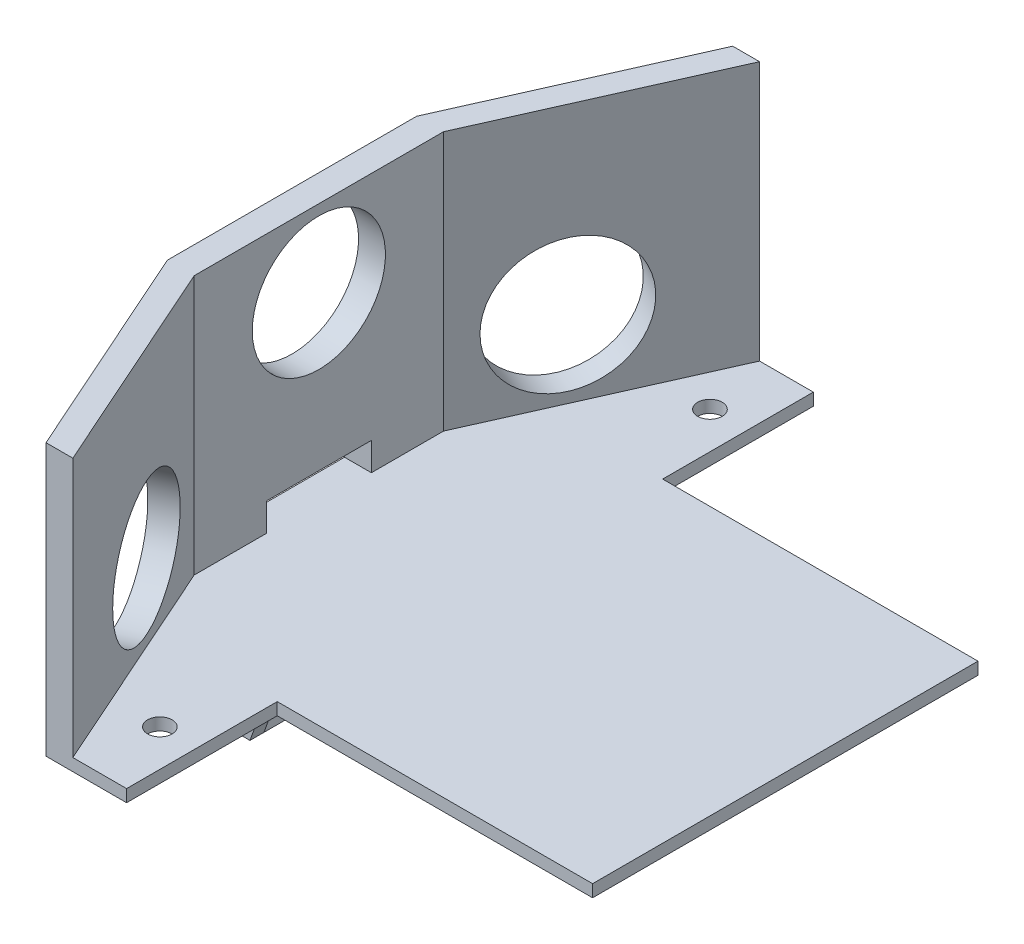
ISO-10303-21;
HEADER;
FILE_DESCRIPTION(('STEP AP214'),'2;1');
FILE_NAME('part.step','',(''),(''),'','','');
FILE_SCHEMA(('AUTOMOTIVE_DESIGN { 1 0 10303 214 1 1 1 1 }'));
ENDSEC;
DATA;
#1=APPLICATION_CONTEXT('core data for automotive mechanical design processes');
#2=APPLICATION_PROTOCOL_DEFINITION('international standard','automotive_design',2000,#1);
#3=PRODUCT_CONTEXT('',#1,'mechanical');
#4=PRODUCT('Part','Part','',(#3));
#5=PRODUCT_RELATED_PRODUCT_CATEGORY('part','',(#4));
#6=PRODUCT_DEFINITION_FORMATION('','',#4);
#7=PRODUCT_DEFINITION_CONTEXT('part definition',#1,'design');
#8=PRODUCT_DEFINITION('design','',#6,#7);
#9=PRODUCT_DEFINITION_SHAPE('','',#8);
#10=(LENGTH_UNIT() NAMED_UNIT(*) SI_UNIT(.MILLI.,.METRE.));
#11=(NAMED_UNIT(*) PLANE_ANGLE_UNIT() SI_UNIT($,.RADIAN.));
#12=(NAMED_UNIT(*) SI_UNIT($,.STERADIAN.) SOLID_ANGLE_UNIT());
#13=UNCERTAINTY_MEASURE_WITH_UNIT(LENGTH_MEASURE(1.E-05),#10,'distance_accuracy_value','');
#14=(GEOMETRIC_REPRESENTATION_CONTEXT(3) GLOBAL_UNCERTAINTY_ASSIGNED_CONTEXT((#13)) GLOBAL_UNIT_ASSIGNED_CONTEXT((#10,
#11,#12)) REPRESENTATION_CONTEXT('',''));
#15=CARTESIAN_POINT('',(0.,0.,0.));
#16=DIRECTION('',(0.,0.,1.));
#17=DIRECTION('',(1.,0.,0.));
#18=AXIS2_PLACEMENT_3D('',#15,#16,#17);
#19=CARTESIAN_POINT('',(0.,3.,0.));
#20=DIRECTION('',(0.,-1.,0.));
#21=DIRECTION('',(0.,0.,-1.));
#22=AXIS2_PLACEMENT_3D('',#19,#20,#21);
#23=PLANE('',#22);
#24=CARTESIAN_POINT('',(-142.75,3.,-39.5));
#25=DIRECTION('',(0.,1.,0.));
#26=DIRECTION('',(0.,0.,1.));
#27=AXIS2_PLACEMENT_3D('',#24,#25,#26);
#28=CIRCLE('',#27,1.75000000000001);
#29=CARTESIAN_POINT('',(-142.75,3.,-37.75));
#30=VERTEX_POINT('',#29);
#31=EDGE_CURVE('E414',#30,#30,#28,.T.);
#32=ORIENTED_EDGE('',*,*,#31,.T.);
#33=EDGE_LOOP('',(#32));
#34=FACE_BOUND('',#33,.T.);
#35=CARTESIAN_POINT('',(-142.75,3.,38.9999999999498));
#36=DIRECTION('',(0.,1.,0.));
#37=DIRECTION('',(0.,0.,1.));
#38=AXIS2_PLACEMENT_3D('',#35,#36,#37);
#39=CIRCLE('',#38,1.74999999998534);
#40=CARTESIAN_POINT('',(-142.75,3.,40.7499999999352));
#41=VERTEX_POINT('',#40);
#42=EDGE_CURVE('E409',#41,#41,#39,.T.);
#43=ORIENTED_EDGE('',*,*,#42,.T.);
#44=EDGE_LOOP('',(#43));
#45=FACE_BOUND('',#44,.T.);
#46=DIRECTION('',(0.,0.,1.));
#47=VECTOR('',#46,1.);
#48=CARTESIAN_POINT('',(-161.39501899441,3.,-7.5));
#49=LINE('',#48,#47);
#50=CARTESIAN_POINT('',(-161.39501899441,3.,-5.5));
#51=VERTEX_POINT('',#50);
#52=CARTESIAN_POINT('',(-161.39501899441,3.,5.5));
#53=VERTEX_POINT('',#52);
#54=EDGE_CURVE('E316',#51,#53,#49,.T.);
#55=ORIENTED_EDGE('',*,*,#54,.F.);
#56=DIRECTION('',(-1.,0.,0.));
#57=VECTOR('',#56,1.);
#58=CARTESIAN_POINT('',(-152.39501899441,3.,-5.5));
#59=LINE('',#58,#57);
#60=CARTESIAN_POINT('',(-152.39501899441,3.,-5.5));
#61=VERTEX_POINT('',#60);
#62=EDGE_CURVE('E254',#61,#51,#59,.T.);
#63=ORIENTED_EDGE('',*,*,#62,.F.);
#64=DIRECTION('',(0.,0.,-1.));
#65=VECTOR('',#64,1.);
#66=CARTESIAN_POINT('',(-152.39501899441,3.,-5.5));
#67=LINE('',#66,#65);
#68=CARTESIAN_POINT('',(-152.39501899441,3.,-7.5));
#69=VERTEX_POINT('',#68);
#70=EDGE_CURVE('E264',#61,#69,#67,.T.);
#71=ORIENTED_EDGE('',*,*,#70,.T.);
#72=DIRECTION('',(1.,0.,0.));
#73=VECTOR('',#72,1.);
#74=CARTESIAN_POINT('',(-162.89501899441,3.,-7.5));
#75=LINE('',#74,#73);
#76=CARTESIAN_POINT('',(-162.89501899441,3.,-7.5));
#77=VERTEX_POINT('',#76);
#78=EDGE_CURVE('E292',#77,#69,#75,.T.);
#79=ORIENTED_EDGE('',*,*,#78,.F.);
#80=DIRECTION('',(0.,0.,1.));
#81=VECTOR('',#80,1.);
#82=CARTESIAN_POINT('',(-162.89501899441,3.,17.791276364422));
#83=LINE('',#82,#81);
#84=CARTESIAN_POINT('',(-162.89501899441,3.,-17.791276364422));
#85=VERTEX_POINT('',#84);
#86=EDGE_CURVE('E463',#85,#77,#83,.T.);
#87=ORIENTED_EDGE('',*,*,#86,.F.);
#88=DIRECTION('',(-0.406736643075407,0.,0.913545457642776));
#89=VECTOR('',#88,1.);
#90=CARTESIAN_POINT('',(-162.89501899441,3.,-17.791276364422));
#91=LINE('',#90,#89);
#92=CARTESIAN_POINT('',(-149.,3.,-49.));
#93=VERTEX_POINT('',#92);
#94=EDGE_CURVE('E459',#93,#85,#91,.T.);
#95=ORIENTED_EDGE('',*,*,#94,.F.);
#96=DIRECTION('',(-1.,0.,0.));
#97=VECTOR('',#96,1.);
#98=CARTESIAN_POINT('',(-149.,3.,-49.));
#99=LINE('',#98,#97);
#100=CARTESIAN_POINT('',(-137.5,3.,-49.));
#101=VERTEX_POINT('',#100);
#102=EDGE_CURVE('E456',#101,#93,#99,.T.);
#103=ORIENTED_EDGE('',*,*,#102,.F.);
#104=DIRECTION('',(0.,0.,-1.));
#105=VECTOR('',#104,1.);
#106=CARTESIAN_POINT('',(-137.5,3.,-49.));
#107=LINE('',#106,#105);
#108=CARTESIAN_POINT('',(-137.5,3.,-27.5));
#109=VERTEX_POINT('',#108);
#110=EDGE_CURVE('E453',#109,#101,#107,.T.);
#111=ORIENTED_EDGE('',*,*,#110,.F.);
#112=DIRECTION('',(-1.,0.,0.));
#113=VECTOR('',#112,1.);
#114=CARTESIAN_POINT('',(-137.5,3.,-27.5));
#115=LINE('',#114,#113);
#116=CARTESIAN_POINT('',(-92.4999999999998,3.,-27.5));
#117=VERTEX_POINT('',#116);
#118=EDGE_CURVE('E422',#117,#109,#115,.T.);
#119=ORIENTED_EDGE('',*,*,#118,.F.);
#120=DIRECTION('',(0.,0.,-1.));
#121=VECTOR('',#120,1.);
#122=CARTESIAN_POINT('',(-92.4999999999998,3.,-27.5));
#123=LINE('',#122,#121);
#124=CARTESIAN_POINT('',(-92.4999999999998,3.,27.5));
#125=VERTEX_POINT('',#124);
#126=EDGE_CURVE('E431',#125,#117,#123,.T.);
#127=ORIENTED_EDGE('',*,*,#126,.F.);
#128=DIRECTION('',(1.,0.,0.));
#129=VECTOR('',#128,1.);
#130=CARTESIAN_POINT('',(-92.4999999999998,3.,27.5));
#131=LINE('',#130,#129);
#132=CARTESIAN_POINT('',(-137.499999999887,3.,27.5));
#133=VERTEX_POINT('',#132);
#134=EDGE_CURVE('E476',#133,#125,#131,.T.);
#135=ORIENTED_EDGE('',*,*,#134,.F.);
#136=DIRECTION('',(0.,0.,-1.));
#137=VECTOR('',#136,1.);
#138=CARTESIAN_POINT('',(-137.499999999887,3.,27.5));
#139=LINE('',#138,#137);
#140=CARTESIAN_POINT('',(-137.499999999887,3.,48.9999999999498));
#141=VERTEX_POINT('',#140);
#142=EDGE_CURVE('E473',#141,#133,#139,.T.);
#143=ORIENTED_EDGE('',*,*,#142,.F.);
#144=DIRECTION('',(1.,0.,0.));
#145=VECTOR('',#144,1.);
#146=CARTESIAN_POINT('',(-137.499999999887,3.,48.9999999999498));
#147=LINE('',#146,#145);
#148=CARTESIAN_POINT('',(-148.999999999887,3.,48.9999999999498));
#149=VERTEX_POINT('',#148);
#150=EDGE_CURVE('E470',#149,#141,#147,.T.);
#151=ORIENTED_EDGE('',*,*,#150,.F.);
#152=DIRECTION('',(0.406736643078705,0.,0.913545457641307));
#153=VECTOR('',#152,1.);
#154=CARTESIAN_POINT('',(-148.999999999887,3.,48.9999999999498));
#155=LINE('',#154,#153);
#156=CARTESIAN_POINT('',(-162.89501899441,3.,17.791276364422));
#157=VERTEX_POINT('',#156);
#158=EDGE_CURVE('E467',#157,#149,#155,.T.);
#159=ORIENTED_EDGE('',*,*,#158,.F.);
#160=CARTESIAN_POINT('',(-162.89501899441,3.,7.5));
#161=VERTEX_POINT('',#160);
#162=EDGE_CURVE('E462',#161,#157,#83,.T.);
#163=ORIENTED_EDGE('',*,*,#162,.F.);
#164=DIRECTION('',(-1.,0.,0.));
#165=VECTOR('',#164,1.);
#166=CARTESIAN_POINT('',(-162.89501899441,3.,7.5));
#167=LINE('',#166,#165);
#168=CARTESIAN_POINT('',(-152.39501899441,3.,7.5));
#169=VERTEX_POINT('',#168);
#170=EDGE_CURVE('E301',#169,#161,#167,.T.);
#171=ORIENTED_EDGE('',*,*,#170,.F.);
#172=DIRECTION('',(0.,0.,1.));
#173=VECTOR('',#172,1.);
#174=CARTESIAN_POINT('',(-152.39501899441,3.,5.5));
#175=LINE('',#174,#173);
#176=CARTESIAN_POINT('',(-152.39501899441,3.,5.5));
#177=VERTEX_POINT('',#176);
#178=EDGE_CURVE('E288',#177,#169,#175,.T.);
#179=ORIENTED_EDGE('',*,*,#178,.F.);
#180=DIRECTION('',(-1.,0.,0.));
#181=VECTOR('',#180,1.);
#182=CARTESIAN_POINT('',(-152.39501899441,3.,5.5));
#183=LINE('',#182,#181);
#184=EDGE_CURVE('E272',#177,#53,#183,.T.);
#185=ORIENTED_EDGE('',*,*,#184,.T.);
#186=EDGE_LOOP('',(#55,#63,#71,#79,#87,#95,#103,#111,#119,#127,#135,#143,#151,#159,#163,#171,
#179,#185));
#187=FACE_BOUND('',#186,.T.);
#188=ADVANCED_FACE('F40',(#34,#45,#187),#23,.T.);
#189=CARTESIAN_POINT('',(-161.39501899441,-22.,-7.5));
#190=DIRECTION('',(-1.,0.,0.));
#191=DIRECTION('',(0.,0.,1.));
#192=AXIS2_PLACEMENT_3D('',#189,#190,#191);
#193=PLANE('',#192);
#194=DIRECTION('',(0.,-1.,0.));
#195=VECTOR('',#194,1.);
#196=CARTESIAN_POINT('',(-161.39501899441,3.,-5.5));
#197=LINE('',#196,#195);
#198=CARTESIAN_POINT('',(-161.39501899441,-22.,-5.5));
#199=VERTEX_POINT('',#198);
#200=EDGE_CURVE('E260',#51,#199,#197,.T.);
#201=ORIENTED_EDGE('',*,*,#200,.F.);
#202=ORIENTED_EDGE('',*,*,#54,.T.);
#203=DIRECTION('',(0.,-1.,0.));
#204=VECTOR('',#203,1.);
#205=CARTESIAN_POINT('',(-161.39501899441,3.,5.5));
#206=LINE('',#205,#204);
#207=CARTESIAN_POINT('',(-161.39501899441,-22.,5.5));
#208=VERTEX_POINT('',#207);
#209=EDGE_CURVE('E276',#53,#208,#206,.T.);
#210=ORIENTED_EDGE('',*,*,#209,.T.);
#211=DIRECTION('',(0.,0.,1.));
#212=VECTOR('',#211,1.);
#213=CARTESIAN_POINT('',(-161.39501899441,-22.,-7.5));
#214=LINE('',#213,#212);
#215=EDGE_CURVE('E305',#199,#208,#214,.T.);
#216=ORIENTED_EDGE('',*,*,#215,.F.);
#217=EDGE_LOOP('',(#201,#202,#210,#216));
#218=FACE_BOUND('',#217,.T.);
#219=ADVANCED_FACE('F593',(#218),#193,.F.);
#220=CARTESIAN_POINT('',(0.,4.75,0.));
#221=DIRECTION('',(0.,-1.,0.));
#222=DIRECTION('',(0.,0.,-1.));
#223=AXIS2_PLACEMENT_3D('',#220,#221,#222);
#224=PLANE('',#223);
#225=CARTESIAN_POINT('',(-142.75,4.75,38.9999999999498));
#226=DIRECTION('',(0.,1.,0.));
#227=DIRECTION('',(0.,0.,1.));
#228=AXIS2_PLACEMENT_3D('',#225,#226,#227);
#229=CIRCLE('',#228,1.74999999998534);
#230=CARTESIAN_POINT('',(-142.75,4.75,40.7499999999352));
#231=VERTEX_POINT('',#230);
#232=EDGE_CURVE('E410',#231,#231,#229,.T.);
#233=ORIENTED_EDGE('',*,*,#232,.F.);
#234=EDGE_LOOP('',(#233));
#235=FACE_BOUND('',#234,.T.);
#236=CARTESIAN_POINT('',(-142.75,4.75,-39.5));
#237=DIRECTION('',(0.,1.,0.));
#238=DIRECTION('',(0.,0.,1.));
#239=AXIS2_PLACEMENT_3D('',#236,#237,#238);
#240=CIRCLE('',#239,1.75000000000001);
#241=CARTESIAN_POINT('',(-142.75,4.75,-37.75));
#242=VERTEX_POINT('',#241);
#243=EDGE_CURVE('E418',#242,#242,#240,.T.);
#244=ORIENTED_EDGE('',*,*,#243,.F.);
#245=EDGE_LOOP('',(#244));
#246=FACE_BOUND('',#245,.T.);
#247=DIRECTION('',(0.406736643075407,0.,-0.913545457642776));
#248=VECTOR('',#247,1.);
#249=CARTESIAN_POINT('',(-145.16877302523,4.75,-49.));
#250=LINE('',#249,#248);
#251=CARTESIAN_POINT('',(-159.063792019639,4.75,-17.791276364422));
#252=VERTEX_POINT('',#251);
#253=CARTESIAN_POINT('',(-145.16877302523,4.75,-49.));
#254=VERTEX_POINT('',#253);
#255=EDGE_CURVE('E359',#252,#254,#250,.T.);
#256=ORIENTED_EDGE('',*,*,#255,.F.);
#257=DIRECTION('',(0.,0.,-1.));
#258=VECTOR('',#257,1.);
#259=CARTESIAN_POINT('',(-159.063792019639,4.75,-17.791276364422));
#260=LINE('',#259,#258);
#261=CARTESIAN_POINT('',(-159.063792019639,4.75,-7.5));
#262=VERTEX_POINT('',#261);
#263=EDGE_CURVE('E387',#262,#252,#260,.T.);
#264=ORIENTED_EDGE('',*,*,#263,.F.);
#265=DIRECTION('',(1.,0.,0.));
#266=VECTOR('',#265,1.);
#267=CARTESIAN_POINT('',(-162.89601899441,4.75,-7.5));
#268=LINE('',#267,#266);
#269=CARTESIAN_POINT('',(-162.89501899441,4.75,-7.5));
#270=VERTEX_POINT('',#269);
#271=EDGE_CURVE('E215',#270,#262,#268,.T.);
#272=ORIENTED_EDGE('',*,*,#271,.F.);
#273=DIRECTION('',(0.,0.,1.));
#274=VECTOR('',#273,1.);
#275=CARTESIAN_POINT('',(-162.89501899441,4.75,7.5));
#276=LINE('',#275,#274);
#277=CARTESIAN_POINT('',(-162.89501899441,4.75,7.5));
#278=VERTEX_POINT('',#277);
#279=EDGE_CURVE('E219',#270,#278,#276,.T.);
#280=ORIENTED_EDGE('',*,*,#279,.T.);
#281=DIRECTION('',(1.,0.,0.));
#282=VECTOR('',#281,1.);
#283=CARTESIAN_POINT('',(-162.89601899441,4.75,7.5));
#284=LINE('',#283,#282);
#285=CARTESIAN_POINT('',(-159.063792019639,4.75,7.5));
#286=VERTEX_POINT('',#285);
#287=EDGE_CURVE('E206',#278,#286,#284,.T.);
#288=ORIENTED_EDGE('',*,*,#287,.T.);
#289=CARTESIAN_POINT('',(-159.063792019639,4.75,17.791276364422));
#290=VERTEX_POINT('',#289);
#291=EDGE_CURVE('E388',#290,#286,#260,.T.);
#292=ORIENTED_EDGE('',*,*,#291,.F.);
#293=DIRECTION('',(-0.406736643078705,0.,-0.913545457641307));
#294=VECTOR('',#293,1.);
#295=CARTESIAN_POINT('',(-159.063792019639,4.75,17.791276364422));
#296=LINE('',#295,#294);
#297=CARTESIAN_POINT('',(-145.168773025117,4.75,48.9999999999498));
#298=VERTEX_POINT('',#297);
#299=EDGE_CURVE('E353',#298,#290,#296,.T.);
#300=ORIENTED_EDGE('',*,*,#299,.F.);
#301=DIRECTION('',(1.,0.,0.));
#302=VECTOR('',#301,1.);
#303=CARTESIAN_POINT('',(-137.499999999887,4.75,48.9999999999498));
#304=LINE('',#303,#302);
#305=CARTESIAN_POINT('',(-137.499999999887,4.75,48.9999999999498));
#306=VERTEX_POINT('',#305);
#307=EDGE_CURVE('E437',#298,#306,#304,.T.);
#308=ORIENTED_EDGE('',*,*,#307,.T.);
#309=DIRECTION('',(0.,0.,-1.));
#310=VECTOR('',#309,1.);
#311=CARTESIAN_POINT('',(-137.499999999887,4.75,27.5));
#312=LINE('',#311,#310);
#313=CARTESIAN_POINT('',(-137.499999999887,4.75,27.5));
#314=VERTEX_POINT('',#313);
#315=EDGE_CURVE('E440',#306,#314,#312,.T.);
#316=ORIENTED_EDGE('',*,*,#315,.T.);
#317=DIRECTION('',(1.,0.,0.));
#318=VECTOR('',#317,1.);
#319=CARTESIAN_POINT('',(-92.4999999999998,4.75,27.5));
#320=LINE('',#319,#318);
#321=CARTESIAN_POINT('',(-92.4999999999998,4.75,27.5));
#322=VERTEX_POINT('',#321);
#323=EDGE_CURVE('E443',#314,#322,#320,.T.);
#324=ORIENTED_EDGE('',*,*,#323,.T.);
#325=DIRECTION('',(0.,0.,-1.));
#326=VECTOR('',#325,1.);
#327=CARTESIAN_POINT('',(-92.4999999999998,4.75,-27.5));
#328=LINE('',#327,#326);
#329=CARTESIAN_POINT('',(-92.4999999999998,4.75,-27.5));
#330=VERTEX_POINT('',#329);
#331=EDGE_CURVE('E446',#322,#330,#328,.T.);
#332=ORIENTED_EDGE('',*,*,#331,.T.);
#333=DIRECTION('',(-1.,0.,0.));
#334=VECTOR('',#333,1.);
#335=CARTESIAN_POINT('',(-137.5,4.75,-27.5));
#336=LINE('',#335,#334);
#337=CARTESIAN_POINT('',(-137.5,4.75,-27.5));
#338=VERTEX_POINT('',#337);
#339=EDGE_CURVE('E426',#330,#338,#336,.T.);
#340=ORIENTED_EDGE('',*,*,#339,.T.);
#341=DIRECTION('',(0.,0.,-1.));
#342=VECTOR('',#341,1.);
#343=CARTESIAN_POINT('',(-137.5,4.75,-49.));
#344=LINE('',#343,#342);
#345=CARTESIAN_POINT('',(-137.5,4.75,-49.));
#346=VERTEX_POINT('',#345);
#347=EDGE_CURVE('E430',#338,#346,#344,.T.);
#348=ORIENTED_EDGE('',*,*,#347,.T.);
#349=DIRECTION('',(-1.,0.,0.));
#350=VECTOR('',#349,1.);
#351=CARTESIAN_POINT('',(-149.,4.75,-49.));
#352=LINE('',#351,#350);
#353=EDGE_CURVE('E434',#346,#254,#352,.T.);
#354=ORIENTED_EDGE('',*,*,#353,.T.);
#355=EDGE_LOOP('',(#256,#264,#272,#280,#288,#292,#300,#308,#316,#324,#332,#340,#348,#354));
#356=FACE_BOUND('',#355,.T.);
#357=ADVANCED_FACE('F221',(#235,#246,#356),#224,.F.);
#358=CARTESIAN_POINT('',(-137.5,4.75,-27.5));
#359=DIRECTION('',(0.,0.,1.));
#360=DIRECTION('',(1.,0.,0.));
#361=AXIS2_PLACEMENT_3D('',#358,#359,#360);
#362=PLANE('',#361);
#363=ORIENTED_EDGE('',*,*,#118,.T.);
#364=DIRECTION('',(0.,-1.,0.));
#365=VECTOR('',#364,1.);
#366=CARTESIAN_POINT('',(-137.5,4.75,-27.5));
#367=LINE('',#366,#365);
#368=EDGE_CURVE('E11',#338,#109,#367,.T.);
#369=ORIENTED_EDGE('',*,*,#368,.F.);
#370=ORIENTED_EDGE('',*,*,#339,.F.);
#371=DIRECTION('',(0.,-1.,0.));
#372=VECTOR('',#371,1.);
#373=CARTESIAN_POINT('',(-92.4999999999998,4.75,-27.5));
#374=LINE('',#373,#372);
#375=EDGE_CURVE('E449',#330,#117,#374,.T.);
#376=ORIENTED_EDGE('',*,*,#375,.T.);
#377=EDGE_LOOP('',(#363,#369,#370,#376));
#378=FACE_BOUND('',#377,.T.);
#379=ADVANCED_FACE('F42',(#378),#362,.F.);
#380=CARTESIAN_POINT('',(-137.5,4.75,-49.));
#381=DIRECTION('',(-1.,0.,0.));
#382=DIRECTION('',(0.,0.,1.));
#383=AXIS2_PLACEMENT_3D('',#380,#381,#382);
#384=PLANE('',#383);
#385=ORIENTED_EDGE('',*,*,#110,.T.);
#386=DIRECTION('',(0.,-1.,0.));
#387=VECTOR('',#386,1.);
#388=CARTESIAN_POINT('',(-137.5,4.75,-49.));
#389=LINE('',#388,#387);
#390=EDGE_CURVE('E49',#346,#101,#389,.T.);
#391=ORIENTED_EDGE('',*,*,#390,.F.);
#392=ORIENTED_EDGE('',*,*,#347,.F.);
#393=ORIENTED_EDGE('',*,*,#368,.T.);
#394=EDGE_LOOP('',(#385,#391,#392,#393));
#395=FACE_BOUND('',#394,.T.);
#396=ADVANCED_FACE('F541',(#395),#384,.F.);
#397=CARTESIAN_POINT('',(-149.,4.75,-49.));
#398=DIRECTION('',(0.,0.,1.));
#399=DIRECTION('',(1.,0.,0.));
#400=AXIS2_PLACEMENT_3D('',#397,#398,#399);
#401=PLANE('',#400);
#402=ORIENTED_EDGE('',*,*,#102,.T.);
#403=DIRECTION('',(0.,-1.,0.));
#404=VECTOR('',#403,1.);
#405=CARTESIAN_POINT('',(-149.,4.75,-49.));
#406=LINE('',#405,#404);
#407=CARTESIAN_POINT('',(-149.,41.75,-49.));
#408=VERTEX_POINT('',#407);
#409=EDGE_CURVE('E508',#408,#93,#406,.T.);
#410=ORIENTED_EDGE('',*,*,#409,.F.);
#411=DIRECTION('',(-1.,0.,0.));
#412=VECTOR('',#411,1.);
#413=CARTESIAN_POINT('',(-149.,41.75,-49.));
#414=LINE('',#413,#412);
#415=CARTESIAN_POINT('',(-145.16877302523,41.75,-49.));
#416=VERTEX_POINT('',#415);
#417=EDGE_CURVE('E379',#416,#408,#414,.T.);
#418=ORIENTED_EDGE('',*,*,#417,.F.);
#419=DIRECTION('',(0.,-1.,0.));
#420=VECTOR('',#419,1.);
#421=CARTESIAN_POINT('',(-145.16877302523,41.75,-49.));
#422=LINE('',#421,#420);
#423=EDGE_CURVE('E383',#416,#254,#422,.T.);
#424=ORIENTED_EDGE('',*,*,#423,.T.);
#425=ORIENTED_EDGE('',*,*,#353,.F.);
#426=ORIENTED_EDGE('',*,*,#390,.T.);
#427=EDGE_LOOP('',(#402,#410,#418,#424,#425,#426));
#428=FACE_BOUND('',#427,.T.);
#429=ADVANCED_FACE('F517',(#428),#401,.F.);
#430=CARTESIAN_POINT('',(-162.89501899441,4.75,-17.791276364422));
#431=DIRECTION('',(0.913545457642776,0.,0.406736643075407));
#432=DIRECTION('',(0.406736643075407,0.,-0.913545457642776));
#433=AXIS2_PLACEMENT_3D('',#430,#431,#432);
#434=PLANE('',#433);
#435=CARTESIAN_POINT('',(-156.793969348261,15.75,-31.4944582291032));
#436=DIRECTION('',(-0.913545457642776,0.,-0.406736643075407));
#437=DIRECTION('',(-0.406736643075407,0.,0.913545457642776));
#438=AXIS2_PLACEMENT_3D('',#435,#436,#437);
#439=CIRCLE('',#438,9.50000000000001);
#440=CARTESIAN_POINT('',(-160.657967457477,15.75,-22.8157763814968));
#441=VERTEX_POINT('',#440);
#442=EDGE_CURVE('E345',#441,#441,#439,.T.);
#443=ORIENTED_EDGE('',*,*,#442,.F.);
#444=EDGE_LOOP('',(#443));
#445=FACE_BOUND('',#444,.T.);
#446=ORIENTED_EDGE('',*,*,#94,.T.);
#447=DIRECTION('',(0.,-1.,0.));
#448=VECTOR('',#447,1.);
#449=CARTESIAN_POINT('',(-162.89501899441,4.75,-17.791276364422));
#450=LINE('',#449,#448);
#451=CARTESIAN_POINT('',(-162.89501899441,41.75,-17.791276364422));
#452=VERTEX_POINT('',#451);
#453=EDGE_CURVE('E504',#452,#85,#450,.T.);
#454=ORIENTED_EDGE('',*,*,#453,.F.);
#455=DIRECTION('',(-0.406736643075407,0.,0.913545457642776));
#456=VECTOR('',#455,1.);
#457=CARTESIAN_POINT('',(-162.89501899441,41.75,-17.791276364422));
#458=LINE('',#457,#456);
#459=EDGE_CURVE('E354',#408,#452,#458,.T.);
#460=ORIENTED_EDGE('',*,*,#459,.F.);
#461=ORIENTED_EDGE('',*,*,#409,.T.);
#462=EDGE_LOOP('',(#446,#454,#460,#461));
#463=FACE_BOUND('',#462,.T.);
#464=ADVANCED_FACE('F525',(#445,#463),#434,.F.);
#465=CARTESIAN_POINT('',(-162.89501899441,4.75,17.791276364422));
#466=DIRECTION('',(1.,0.,0.));
#467=DIRECTION('',(0.,0.,-1.));
#468=AXIS2_PLACEMENT_3D('',#465,#466,#467);
#469=PLANE('',#468);
#470=DIRECTION('',(0.,0.,-1.));
#471=VECTOR('',#470,1.);
#472=CARTESIAN_POINT('',(-162.89501899441,8.75,7.5));
#473=LINE('',#472,#471);
#474=CARTESIAN_POINT('',(-162.89501899441,8.75,7.5));
#475=VERTEX_POINT('',#474);
#476=CARTESIAN_POINT('',(-162.89501899441,8.75,-7.5));
#477=VERTEX_POINT('',#476);
#478=EDGE_CURVE('E231',#475,#477,#473,.T.);
#479=ORIENTED_EDGE('',*,*,#478,.F.);
#480=DIRECTION('',(0.,1.,0.));
#481=VECTOR('',#480,1.);
#482=CARTESIAN_POINT('',(-162.89501899441,4.75,7.5));
#483=LINE('',#482,#481);
#484=EDGE_CURVE('E210',#278,#475,#483,.T.);
#485=ORIENTED_EDGE('',*,*,#484,.F.);
#486=ORIENTED_EDGE('',*,*,#279,.F.);
#487=DIRECTION('',(0.,-1.,0.));
#488=VECTOR('',#487,1.);
#489=CARTESIAN_POINT('',(-162.89501899441,4.75,-7.5));
#490=LINE('',#489,#488);
#491=EDGE_CURVE('E56',#477,#270,#490,.T.);
#492=ORIENTED_EDGE('',*,*,#491,.F.);
#493=EDGE_LOOP('',(#479,#485,#486,#492));
#494=FACE_BOUND('',#493,.T.);
#495=CARTESIAN_POINT('',(-162.89501899441,30.75,0.));
#496=DIRECTION('',(-1.,0.,0.));
#497=DIRECTION('',(0.,0.,1.));
#498=AXIS2_PLACEMENT_3D('',#495,#496,#497);
#499=CIRCLE('',#498,9.5);
#500=CARTESIAN_POINT('',(-162.89501899441,30.75,9.5));
#501=VERTEX_POINT('',#500);
#502=EDGE_CURVE('E329',#501,#501,#499,.T.);
#503=ORIENTED_EDGE('',*,*,#502,.F.);
#504=EDGE_LOOP('',(#503));
#505=FACE_BOUND('',#504,.T.);
#506=ORIENTED_EDGE('',*,*,#86,.T.);
#507=DIRECTION('',(0.,1.,0.));
#508=VECTOR('',#507,1.);
#509=CARTESIAN_POINT('',(-162.89501899441,-22.,-7.5));
#510=LINE('',#509,#508);
#511=CARTESIAN_POINT('',(-162.89501899441,-22.,-7.5));
#512=VERTEX_POINT('',#511);
#513=EDGE_CURVE('E325',#512,#77,#510,.T.);
#514=ORIENTED_EDGE('',*,*,#513,.F.);
#515=DIRECTION('',(0.,0.,-1.));
#516=VECTOR('',#515,1.);
#517=CARTESIAN_POINT('',(-162.89501899441,-22.,-7.5));
#518=LINE('',#517,#516);
#519=CARTESIAN_POINT('',(-162.89501899441,-22.,7.5));
#520=VERTEX_POINT('',#519);
#521=EDGE_CURVE('E296',#520,#512,#518,.T.);
#522=ORIENTED_EDGE('',*,*,#521,.F.);
#523=DIRECTION('',(0.,1.,0.));
#524=VECTOR('',#523,1.);
#525=CARTESIAN_POINT('',(-162.89501899441,-22.,7.5));
#526=LINE('',#525,#524);
#527=EDGE_CURVE('E313',#520,#161,#526,.T.);
#528=ORIENTED_EDGE('',*,*,#527,.T.);
#529=ORIENTED_EDGE('',*,*,#162,.T.);
#530=DIRECTION('',(0.,-1.,0.));
#531=VECTOR('',#530,1.);
#532=CARTESIAN_POINT('',(-162.89501899441,4.75,17.791276364422));
#533=LINE('',#532,#531);
#534=CARTESIAN_POINT('',(-162.89501899441,41.75,17.791276364422));
#535=VERTEX_POINT('',#534);
#536=EDGE_CURVE('E500',#535,#157,#533,.T.);
#537=ORIENTED_EDGE('',*,*,#536,.F.);
#538=DIRECTION('',(0.,0.,1.));
#539=VECTOR('',#538,1.);
#540=CARTESIAN_POINT('',(-162.89501899441,41.75,17.791276364422));
#541=LINE('',#540,#539);
#542=EDGE_CURVE('E358',#452,#535,#541,.T.);
#543=ORIENTED_EDGE('',*,*,#542,.F.);
#544=ORIENTED_EDGE('',*,*,#453,.T.);
#545=EDGE_LOOP('',(#506,#514,#522,#528,#529,#537,#543,#544));
#546=FACE_BOUND('',#545,.T.);
#547=ADVANCED_FACE('F228',(#494,#505,#546),#469,.F.);
#548=CARTESIAN_POINT('',(-148.999999999887,4.75,48.9999999999498));
#549=DIRECTION('',(0.913545457641308,0.,-0.406736643078705));
#550=DIRECTION('',(-0.406736643078705,0.,-0.913545457641308));
#551=AXIS2_PLACEMENT_3D('',#548,#549,#550);
#552=PLANE('',#551);
#553=CARTESIAN_POINT('',(-156.793969348228,15.75,31.4944582290454));
#554=DIRECTION('',(-0.913545457641307,0.,0.406736643078705));
#555=DIRECTION('',(0.406736643078705,0.,0.913545457641307));
#556=AXIS2_PLACEMENT_3D('',#553,#554,#555);
#557=CIRCLE('',#556,9.50000000000001);
#558=CARTESIAN_POINT('',(-152.92997123898,15.75,40.1731400766378));
#559=VERTEX_POINT('',#558);
#560=EDGE_CURVE('E337',#559,#559,#557,.T.);
#561=ORIENTED_EDGE('',*,*,#560,.F.);
#562=EDGE_LOOP('',(#561));
#563=FACE_BOUND('',#562,.T.);
#564=ORIENTED_EDGE('',*,*,#158,.T.);
#565=DIRECTION('',(0.,-1.,0.));
#566=VECTOR('',#565,1.);
#567=CARTESIAN_POINT('',(-148.999999999887,4.75,48.9999999999498));
#568=LINE('',#567,#566);
#569=CARTESIAN_POINT('',(-148.999999999887,41.75,48.9999999999498));
#570=VERTEX_POINT('',#569);
#571=EDGE_CURVE('E496',#570,#149,#568,.T.);
#572=ORIENTED_EDGE('',*,*,#571,.F.);
#573=DIRECTION('',(0.406736643078705,0.,0.913545457641307));
#574=VECTOR('',#573,1.);
#575=CARTESIAN_POINT('',(-148.999999999887,41.75,48.9999999999498));
#576=LINE('',#575,#574);
#577=EDGE_CURVE('E363',#535,#570,#576,.T.);
#578=ORIENTED_EDGE('',*,*,#577,.F.);
#579=ORIENTED_EDGE('',*,*,#536,.T.);
#580=EDGE_LOOP('',(#564,#572,#578,#579));
#581=FACE_BOUND('',#580,.T.);
#582=ADVANCED_FACE('F567',(#563,#581),#552,.F.);
#583=CARTESIAN_POINT('',(-137.499999999887,4.75,48.9999999999498));
#584=DIRECTION('',(0.,0.,-1.));
#585=DIRECTION('',(-1.,0.,0.));
#586=AXIS2_PLACEMENT_3D('',#583,#584,#585);
#587=PLANE('',#586);
#588=ORIENTED_EDGE('',*,*,#150,.T.);
#589=DIRECTION('',(0.,-1.,0.));
#590=VECTOR('',#589,1.);
#591=CARTESIAN_POINT('',(-137.499999999887,4.75,48.9999999999498));
#592=LINE('',#591,#590);
#593=EDGE_CURVE('E492',#306,#141,#592,.T.);
#594=ORIENTED_EDGE('',*,*,#593,.F.);
#595=ORIENTED_EDGE('',*,*,#307,.F.);
#596=DIRECTION('',(0.,-1.,0.));
#597=VECTOR('',#596,1.);
#598=CARTESIAN_POINT('',(-145.168773025117,41.75,48.9999999999498));
#599=LINE('',#598,#597);
#600=CARTESIAN_POINT('',(-145.168773025117,41.75,48.9999999999498));
#601=VERTEX_POINT('',#600);
#602=EDGE_CURVE('E405',#601,#298,#599,.T.);
#603=ORIENTED_EDGE('',*,*,#602,.F.);
#604=DIRECTION('',(1.,0.,0.));
#605=VECTOR('',#604,1.);
#606=CARTESIAN_POINT('',(-145.168773025117,41.75,48.9999999999498));
#607=LINE('',#606,#605);
#608=EDGE_CURVE('E367',#570,#601,#607,.T.);
#609=ORIENTED_EDGE('',*,*,#608,.F.);
#610=ORIENTED_EDGE('',*,*,#571,.T.);
#611=EDGE_LOOP('',(#588,#594,#595,#603,#609,#610));
#612=FACE_BOUND('',#611,.T.);
#613=ADVANCED_FACE('F562',(#612),#587,.F.);
#614=CARTESIAN_POINT('',(-137.499999999887,4.75,27.5));
#615=DIRECTION('',(-1.,0.,0.));
#616=DIRECTION('',(0.,0.,1.));
#617=AXIS2_PLACEMENT_3D('',#614,#615,#616);
#618=PLANE('',#617);
#619=ORIENTED_EDGE('',*,*,#142,.T.);
#620=DIRECTION('',(0.,-1.,0.));
#621=VECTOR('',#620,1.);
#622=CARTESIAN_POINT('',(-137.499999999887,4.75,27.5));
#623=LINE('',#622,#621);
#624=EDGE_CURVE('E488',#314,#133,#623,.T.);
#625=ORIENTED_EDGE('',*,*,#624,.F.);
#626=ORIENTED_EDGE('',*,*,#315,.F.);
#627=ORIENTED_EDGE('',*,*,#593,.T.);
#628=EDGE_LOOP('',(#619,#625,#626,#627));
#629=FACE_BOUND('',#628,.T.);
#630=ADVANCED_FACE('F557',(#629),#618,.F.);
#631=CARTESIAN_POINT('',(-92.4999999999998,4.75,27.5));
#632=DIRECTION('',(0.,0.,-1.));
#633=DIRECTION('',(-1.,0.,0.));
#634=AXIS2_PLACEMENT_3D('',#631,#632,#633);
#635=PLANE('',#634);
#636=ORIENTED_EDGE('',*,*,#134,.T.);
#637=DIRECTION('',(0.,-1.,0.));
#638=VECTOR('',#637,1.);
#639=CARTESIAN_POINT('',(-92.4999999999998,4.75,27.5));
#640=LINE('',#639,#638);
#641=EDGE_CURVE('E484',#322,#125,#640,.T.);
#642=ORIENTED_EDGE('',*,*,#641,.F.);
#643=ORIENTED_EDGE('',*,*,#323,.F.);
#644=ORIENTED_EDGE('',*,*,#624,.T.);
#645=EDGE_LOOP('',(#636,#642,#643,#644));
#646=FACE_BOUND('',#645,.T.);
#647=ADVANCED_FACE('F553',(#646),#635,.F.);
#648=CARTESIAN_POINT('',(-92.4999999999998,4.75,-27.5));
#649=DIRECTION('',(-1.,0.,0.));
#650=DIRECTION('',(0.,0.,1.));
#651=AXIS2_PLACEMENT_3D('',#648,#649,#650);
#652=PLANE('',#651);
#653=ORIENTED_EDGE('',*,*,#126,.T.);
#654=ORIENTED_EDGE('',*,*,#375,.F.);
#655=ORIENTED_EDGE('',*,*,#331,.F.);
#656=ORIENTED_EDGE('',*,*,#641,.T.);
#657=EDGE_LOOP('',(#653,#654,#655,#656));
#658=FACE_BOUND('',#657,.T.);
#659=ADVANCED_FACE('F548',(#658),#652,.F.);
#660=CARTESIAN_POINT('',(-142.75,4.75,-39.5));
#661=DIRECTION('',(0.,-1.,0.));
#662=DIRECTION('',(0.,0.,-1.));
#663=AXIS2_PLACEMENT_3D('',#660,#661,#662);
#664=CYLINDRICAL_SURFACE('',#663,1.75000000000001);
#665=ORIENTED_EDGE('',*,*,#243,.T.);
#666=EDGE_LOOP('',(#665));
#667=FACE_BOUND('',#666,.T.);
#668=ORIENTED_EDGE('',*,*,#31,.F.);
#669=EDGE_LOOP('',(#668));
#670=FACE_BOUND('',#669,.T.);
#671=ADVANCED_FACE('F630',(#667,#670),#664,.F.);
#672=CARTESIAN_POINT('',(-142.75,4.75,38.9999999999498));
#673=DIRECTION('',(0.,-1.,0.));
#674=DIRECTION('',(0.,0.,-1.));
#675=AXIS2_PLACEMENT_3D('',#672,#673,#674);
#676=CYLINDRICAL_SURFACE('',#675,1.74999999998534);
#677=ORIENTED_EDGE('',*,*,#232,.T.);
#678=EDGE_LOOP('',(#677));
#679=FACE_BOUND('',#678,.T.);
#680=ORIENTED_EDGE('',*,*,#42,.F.);
#681=EDGE_LOOP('',(#680));
#682=FACE_BOUND('',#681,.T.);
#683=ADVANCED_FACE('F661',(#679,#682),#676,.F.);
#684=CARTESIAN_POINT('',(-159.063792019639,41.75,17.791276364422));
#685=DIRECTION('',(-0.913545457641307,0.,0.406736643078705));
#686=DIRECTION('',(0.406736643078705,0.,0.913545457641308));
#687=AXIS2_PLACEMENT_3D('',#684,#685,#686);
#688=PLANE('',#687);
#689=CARTESIAN_POINT('',(-153.596560246488,15.75,30.0708799782722));
#690=DIRECTION('',(-0.913545457641307,0.,0.406736643078705));
#691=DIRECTION('',(0.406736643078705,0.,0.913545457641308));
#692=AXIS2_PLACEMENT_3D('',#689,#690,#691);
#693=CIRCLE('',#692,9.50000000000001);
#694=CARTESIAN_POINT('',(-149.73256213724,15.75,38.7495618258646));
#695=VERTEX_POINT('',#694);
#696=EDGE_CURVE('E341',#695,#695,#693,.F.);
#697=ORIENTED_EDGE('',*,*,#696,.F.);
#698=EDGE_LOOP('',(#697));
#699=FACE_BOUND('',#698,.T.);
#700=ORIENTED_EDGE('',*,*,#299,.T.);
#701=DIRECTION('',(0.,-1.,0.));
#702=VECTOR('',#701,1.);
#703=CARTESIAN_POINT('',(-159.063792019639,41.75,17.791276364422));
#704=LINE('',#703,#702);
#705=CARTESIAN_POINT('',(-159.063792019639,41.75,17.791276364422));
#706=VERTEX_POINT('',#705);
#707=EDGE_CURVE('E401',#706,#290,#704,.T.);
#708=ORIENTED_EDGE('',*,*,#707,.F.);
#709=DIRECTION('',(-0.406736643078705,0.,-0.913545457641307));
#710=VECTOR('',#709,1.);
#711=CARTESIAN_POINT('',(-159.063792019639,41.75,17.791276364422));
#712=LINE('',#711,#710);
#713=EDGE_CURVE('E370',#601,#706,#712,.T.);
#714=ORIENTED_EDGE('',*,*,#713,.F.);
#715=ORIENTED_EDGE('',*,*,#602,.T.);
#716=EDGE_LOOP('',(#700,#708,#714,#715));
#717=FACE_BOUND('',#716,.T.);
#718=ADVANCED_FACE('F571',(#699,#717),#688,.F.);
#719=CARTESIAN_POINT('',(-159.063792019639,41.75,-17.791276364422));
#720=DIRECTION('',(-1.,0.,0.));
#721=DIRECTION('',(0.,0.,1.));
#722=AXIS2_PLACEMENT_3D('',#719,#720,#721);
#723=PLANE('',#722);
#724=CARTESIAN_POINT('',(-159.063792019639,30.75,0.));
#725=DIRECTION('',(-1.,0.,0.));
#726=DIRECTION('',(0.,0.,1.));
#727=AXIS2_PLACEMENT_3D('',#724,#725,#726);
#728=CIRCLE('',#727,9.5);
#729=CARTESIAN_POINT('',(-159.063792019639,30.75,9.5));
#730=VERTEX_POINT('',#729);
#731=EDGE_CURVE('E333',#730,#730,#728,.F.);
#732=ORIENTED_EDGE('',*,*,#731,.F.);
#733=EDGE_LOOP('',(#732));
#734=FACE_BOUND('',#733,.T.);
#735=ORIENTED_EDGE('',*,*,#291,.T.);
#736=DIRECTION('',(0.,-1.,0.));
#737=VECTOR('',#736,1.);
#738=CARTESIAN_POINT('',(-159.063792019639,4.75,7.5));
#739=LINE('',#738,#737);
#740=CARTESIAN_POINT('',(-159.063792019639,8.75,7.5));
#741=VERTEX_POINT('',#740);
#742=EDGE_CURVE('E64',#741,#286,#739,.T.);
#743=ORIENTED_EDGE('',*,*,#742,.F.);
#744=DIRECTION('',(0.,0.,1.));
#745=VECTOR('',#744,1.);
#746=CARTESIAN_POINT('',(-159.063792019639,8.75,7.5));
#747=LINE('',#746,#745);
#748=CARTESIAN_POINT('',(-159.063792019639,8.75,-7.5));
#749=VERTEX_POINT('',#748);
#750=EDGE_CURVE('E216',#749,#741,#747,.T.);
#751=ORIENTED_EDGE('',*,*,#750,.F.);
#752=DIRECTION('',(0.,1.,0.));
#753=VECTOR('',#752,1.);
#754=CARTESIAN_POINT('',(-159.063792019639,4.75,-7.5));
#755=LINE('',#754,#753);
#756=EDGE_CURVE('E236',#262,#749,#755,.T.);
#757=ORIENTED_EDGE('',*,*,#756,.F.);
#758=ORIENTED_EDGE('',*,*,#263,.T.);
#759=DIRECTION('',(0.,-1.,0.));
#760=VECTOR('',#759,1.);
#761=CARTESIAN_POINT('',(-159.063792019639,41.75,-17.791276364422));
#762=LINE('',#761,#760);
#763=CARTESIAN_POINT('',(-159.063792019639,41.75,-17.791276364422));
#764=VERTEX_POINT('',#763);
#765=EDGE_CURVE('E397',#764,#252,#762,.T.);
#766=ORIENTED_EDGE('',*,*,#765,.F.);
#767=DIRECTION('',(0.,0.,-1.));
#768=VECTOR('',#767,1.);
#769=CARTESIAN_POINT('',(-159.063792019639,41.75,-17.791276364422));
#770=LINE('',#769,#768);
#771=EDGE_CURVE('E373',#706,#764,#770,.T.);
#772=ORIENTED_EDGE('',*,*,#771,.F.);
#773=ORIENTED_EDGE('',*,*,#707,.T.);
#774=EDGE_LOOP('',(#735,#743,#751,#757,#758,#766,#772,#773));
#775=FACE_BOUND('',#774,.T.);
#776=ADVANCED_FACE('F574',(#734,#775),#723,.F.);
#777=CARTESIAN_POINT('',(-145.16877302523,41.75,-49.));
#778=DIRECTION('',(-0.913545457642776,0.,-0.406736643075407));
#779=DIRECTION('',(-0.406736643075407,0.,0.913545457642776));
#780=AXIS2_PLACEMENT_3D('',#777,#778,#779);
#781=PLANE('',#780);
#782=CARTESIAN_POINT('',(-153.596560246511,15.75,-30.0708799783392));
#783=DIRECTION('',(-0.913545457642776,0.,-0.406736643075407));
#784=DIRECTION('',(-0.406736643075407,0.,0.913545457642776));
#785=AXIS2_PLACEMENT_3D('',#782,#783,#784);
#786=CIRCLE('',#785,9.50000000000001);
#787=CARTESIAN_POINT('',(-157.460558355728,15.75,-21.3921981307329));
#788=VERTEX_POINT('',#787);
#789=EDGE_CURVE('E349',#788,#788,#786,.F.);
#790=ORIENTED_EDGE('',*,*,#789,.F.);
#791=EDGE_LOOP('',(#790));
#792=FACE_BOUND('',#791,.T.);
#793=ORIENTED_EDGE('',*,*,#255,.T.);
#794=ORIENTED_EDGE('',*,*,#423,.F.);
#795=DIRECTION('',(0.406736643075407,0.,-0.913545457642776));
#796=VECTOR('',#795,1.);
#797=CARTESIAN_POINT('',(-145.16877302523,41.75,-49.));
#798=LINE('',#797,#796);
#799=EDGE_CURVE('E376',#764,#416,#798,.T.);
#800=ORIENTED_EDGE('',*,*,#799,.F.);
#801=ORIENTED_EDGE('',*,*,#765,.T.);
#802=EDGE_LOOP('',(#793,#794,#800,#801));
#803=FACE_BOUND('',#802,.T.);
#804=ADVANCED_FACE('F537',(#792,#803),#781,.F.);
#805=CARTESIAN_POINT('',(0.,41.75,0.));
#806=DIRECTION('',(0.,-1.,0.));
#807=DIRECTION('',(0.,0.,-1.));
#808=AXIS2_PLACEMENT_3D('',#805,#806,#807);
#809=PLANE('',#808);
#810=ORIENTED_EDGE('',*,*,#459,.T.);
#811=ORIENTED_EDGE('',*,*,#542,.T.);
#812=ORIENTED_EDGE('',*,*,#577,.T.);
#813=ORIENTED_EDGE('',*,*,#608,.T.);
#814=ORIENTED_EDGE('',*,*,#713,.T.);
#815=ORIENTED_EDGE('',*,*,#771,.T.);
#816=ORIENTED_EDGE('',*,*,#799,.T.);
#817=ORIENTED_EDGE('',*,*,#417,.T.);
#818=EDGE_LOOP('',(#810,#811,#812,#813,#814,#815,#816,#817));
#819=FACE_BOUND('',#818,.T.);
#820=ADVANCED_FACE('F532',(#819),#809,.F.);
#821=CARTESIAN_POINT('',(135.88448205478,15.75,98.8143839070603));
#822=DIRECTION('',(-0.913545457642776,0.,-0.406736643075407));
#823=DIRECTION('',(-0.406736643075407,0.,0.913545457642776));
#824=AXIS2_PLACEMENT_3D('',#821,#822,#823);
#825=CYLINDRICAL_SURFACE('',#824,9.50000000000001);
#826=ORIENTED_EDGE('',*,*,#442,.T.);
#827=EDGE_LOOP('',(#826));
#828=FACE_BOUND('',#827,.T.);
#829=ORIENTED_EDGE('',*,*,#789,.T.);
#830=EDGE_LOOP('',(#829));
#831=FACE_BOUND('',#830,.T.);
#832=ADVANCED_FACE('F680',(#828,#831),#825,.F.);
#833=CARTESIAN_POINT('',(133.283475164957,15.75,-97.6563410303249));
#834=DIRECTION('',(-0.913545457641308,0.,0.406736643078705));
#835=DIRECTION('',(0.406736643078705,0.,0.913545457641308));
#836=AXIS2_PLACEMENT_3D('',#833,#834,#835);
#837=CYLINDRICAL_SURFACE('',#836,9.50000000000001);
#838=ORIENTED_EDGE('',*,*,#560,.T.);
#839=EDGE_LOOP('',(#838));
#840=FACE_BOUND('',#839,.T.);
#841=ORIENTED_EDGE('',*,*,#696,.T.);
#842=EDGE_LOOP('',(#841));
#843=FACE_BOUND('',#842,.T.);
#844=ADVANCED_FACE('F683',(#840,#843),#837,.F.);
#845=CARTESIAN_POINT('',(154.501,30.75,0.));
#846=DIRECTION('',(-1.,0.,0.));
#847=DIRECTION('',(0.,0.,1.));
#848=AXIS2_PLACEMENT_3D('',#845,#846,#847);
#849=CYLINDRICAL_SURFACE('',#848,9.5);
#850=CARTESIAN_POINT('',(-162.89501899441,30.75,9.5));
#851=CARTESIAN_POINT('',(-162.855110380089,30.75,9.5));
#852=CARTESIAN_POINT('',(-162.815201765769,30.75,9.5));
#853=CARTESIAN_POINT('',(-162.735384537128,30.75,9.5));
#854=CARTESIAN_POINT('',(-162.695475922807,30.75,9.5));
#855=CARTESIAN_POINT('',(-162.615658694166,30.75,9.5));
#856=CARTESIAN_POINT('',(-162.575750079846,30.75,9.5));
#857=CARTESIAN_POINT('',(-162.495932851204,30.75,9.5));
#858=CARTESIAN_POINT('',(-162.456024236884,30.75,9.5));
#859=CARTESIAN_POINT('',(-162.376207008243,30.75,9.5));
#860=CARTESIAN_POINT('',(-162.336298393922,30.75,9.5));
#861=CARTESIAN_POINT('',(-162.256481165281,30.75,9.5));
#862=CARTESIAN_POINT('',(-162.216572550961,30.75,9.5));
#863=CARTESIAN_POINT('',(-162.13675532232,30.75,9.5));
#864=CARTESIAN_POINT('',(-162.096846707999,30.75,9.5));
#865=CARTESIAN_POINT('',(-162.017029479358,30.75,9.5));
#866=CARTESIAN_POINT('',(-161.977120865038,30.75,9.5));
#867=CARTESIAN_POINT('',(-161.897303636397,30.75,9.5));
#868=CARTESIAN_POINT('',(-161.857395022076,30.75,9.5));
#869=CARTESIAN_POINT('',(-161.777577793435,30.75,9.5));
#870=CARTESIAN_POINT('',(-161.737669179114,30.75,9.5));
#871=CARTESIAN_POINT('',(-161.657851950473,30.75,9.5));
#872=CARTESIAN_POINT('',(-161.617943336153,30.75,9.5));
#873=CARTESIAN_POINT('',(-161.538126107512,30.75,9.5));
#874=CARTESIAN_POINT('',(-161.498217493191,30.75,9.5));
#875=CARTESIAN_POINT('',(-161.41840026455,30.75,9.5));
#876=CARTESIAN_POINT('',(-161.37849165023,30.75,9.5));
#877=CARTESIAN_POINT('',(-161.298674421589,30.75,9.5));
#878=CARTESIAN_POINT('',(-161.258765807268,30.75,9.5));
#879=CARTESIAN_POINT('',(-161.178948578627,30.75,9.5));
#880=CARTESIAN_POINT('',(-161.139039964307,30.75,9.5));
#881=CARTESIAN_POINT('',(-161.059222735666,30.75,9.5));
#882=CARTESIAN_POINT('',(-161.019314121345,30.75,9.5));
#883=CARTESIAN_POINT('',(-160.939496892704,30.75,9.5));
#884=CARTESIAN_POINT('',(-160.899588278383,30.75,9.5));
#885=CARTESIAN_POINT('',(-160.819771049742,30.75,9.5));
#886=CARTESIAN_POINT('',(-160.779862435422,30.75,9.5));
#887=CARTESIAN_POINT('',(-160.700045206781,30.75,9.5));
#888=CARTESIAN_POINT('',(-160.66013659246,30.75,9.5));
#889=CARTESIAN_POINT('',(-160.580319363819,30.75,9.5));
#890=CARTESIAN_POINT('',(-160.540410749499,30.75,9.5));
#891=CARTESIAN_POINT('',(-160.460593520858,30.75,9.5));
#892=CARTESIAN_POINT('',(-160.420684906537,30.75,9.5));
#893=CARTESIAN_POINT('',(-160.340867677896,30.75,9.5));
#894=CARTESIAN_POINT('',(-160.300959063576,30.75,9.5));
#895=CARTESIAN_POINT('',(-160.221141834935,30.75,9.5));
#896=CARTESIAN_POINT('',(-160.181233220614,30.75,9.5));
#897=CARTESIAN_POINT('',(-160.101415991973,30.75,9.5));
#898=CARTESIAN_POINT('',(-160.061507377652,30.75,9.5));
#899=CARTESIAN_POINT('',(-159.981690149011,30.75,9.5));
#900=CARTESIAN_POINT('',(-159.941781534691,30.75,9.5));
#901=CARTESIAN_POINT('',(-159.86196430605,30.75,9.5));
#902=CARTESIAN_POINT('',(-159.822055691729,30.75,9.5));
#903=CARTESIAN_POINT('',(-159.742238463088,30.75,9.5));
#904=CARTESIAN_POINT('',(-159.702329848768,30.75,9.5));
#905=CARTESIAN_POINT('',(-159.622512620127,30.75,9.5));
#906=CARTESIAN_POINT('',(-159.582604005806,30.75,9.5));
#907=CARTESIAN_POINT('',(-159.502786777165,30.75,9.5));
#908=CARTESIAN_POINT('',(-159.462878162845,30.75,9.5));
#909=CARTESIAN_POINT('',(-159.383060934203,30.75,9.5));
#910=CARTESIAN_POINT('',(-159.343152319883,30.75,9.5));
#911=CARTESIAN_POINT('',(-159.263335091242,30.75,9.5));
#912=CARTESIAN_POINT('',(-159.223426476921,30.75,9.5));
#913=CARTESIAN_POINT('',(-159.14360924828,30.75,9.5));
#914=CARTESIAN_POINT('',(-159.10370063396,30.75,9.5));
#915=CARTESIAN_POINT('',(-159.063792019639,30.75,9.5));
#916=B_SPLINE_CURVE_WITH_KNOTS('',3,(#850,#851,#852,#853,#854,#855,#856,#857,#858,#859,#860,
#861,#862,#863,#864,#865,#866,#867,#868,#869,#870,#871,#872,#873,#874,#875,#876,#877,#878,#879,
#880,#881,#882,#883,#884,#885,#886,#887,#888,#889,#890,#891,#892,#893,#894,#895,#896,#897,#898,
#899,#900,#901,#902,#903,#904,#905,#906,#907,#908,#909,#910,#911,#912,#913,#914,#915),
.UNSPECIFIED.,.F.,.F.,(4,2,2,2,2,2,2,2,2,2,2,2,2,2,2,2,2,2,2,2,2,2,2,2,2,2,2,2,2,2,2,2,4),(0.,
0.119725842961604,0.239451685923153,0.359177528884702,0.478903371846306,0.598629214807911,
0.71835505776946,0.838080900731009,0.957806743692613,1.07753258665422,1.19725842961577,
1.31698427257732,1.43671011553892,1.55643595850052,1.67616180146207,1.79588764442362,
1.91561348738523,2.03533933034683,2.15506517330838,2.27479101626993,2.39451685923153,
2.51424270219314,2.63396854515469,2.75369438811623,2.87342023107784,2.99314607403944,
3.11287191700099,3.23259775996254,3.35232360292415,3.47204944588575,3.5917752888473,
3.71150113180885,3.83122697477045),.UNSPECIFIED.);
#917=EDGE_CURVE('BSEAM687',#501,#730,#916,.T.);
#918=ORIENTED_EDGE('',*,*,#502,.T.);
#919=ORIENTED_EDGE('',*,*,#731,.T.);
#920=ORIENTED_EDGE('',*,*,#917,.T.);
#921=ORIENTED_EDGE('',*,*,#917,.F.);
#922=EDGE_LOOP('',(#918,#920,#919,#921));
#923=FACE_BOUND('',#922,.T.);
#924=ADVANCED_FACE('F687',(#923),#849,.F.);
#925=CARTESIAN_POINT('',(-162.89501899441,-22.,-7.5));
#926=DIRECTION('',(0.,0.,1.));
#927=DIRECTION('',(1.,0.,0.));
#928=AXIS2_PLACEMENT_3D('',#925,#926,#927);
#929=PLANE('',#928);
#930=ORIENTED_EDGE('',*,*,#78,.T.);
#931=DIRECTION('',(0.338719468272742,0.940887411868727,0.));
#932=VECTOR('',#931,1.);
#933=CARTESIAN_POINT('',(-161.39501899441,-22.,-7.5));
#934=LINE('',#933,#932);
#935=CARTESIAN_POINT('',(-161.39501899441,-22.,-7.5));
#936=VERTEX_POINT('',#935);
#937=EDGE_CURVE('E225',#936,#69,#934,.T.);
#938=ORIENTED_EDGE('',*,*,#937,.F.);
#939=DIRECTION('',(1.,0.,0.));
#940=VECTOR('',#939,1.);
#941=CARTESIAN_POINT('',(-162.89501899441,-22.,-7.5));
#942=LINE('',#941,#940);
#943=EDGE_CURVE('E300',#512,#936,#942,.T.);
#944=ORIENTED_EDGE('',*,*,#943,.F.);
#945=ORIENTED_EDGE('',*,*,#513,.T.);
#946=EDGE_LOOP('',(#930,#938,#944,#945));
#947=FACE_BOUND('',#946,.T.);
#948=ADVANCED_FACE('F600',(#947),#929,.F.);
#949=CARTESIAN_POINT('',(-162.89501899441,-22.,7.5));
#950=DIRECTION('',(0.,0.,-1.));
#951=DIRECTION('',(-1.,0.,0.));
#952=AXIS2_PLACEMENT_3D('',#949,#950,#951);
#953=PLANE('',#952);
#954=ORIENTED_EDGE('',*,*,#170,.T.);
#955=ORIENTED_EDGE('',*,*,#527,.F.);
#956=DIRECTION('',(-1.,0.,0.));
#957=VECTOR('',#956,1.);
#958=CARTESIAN_POINT('',(-162.89501899441,-22.,7.5));
#959=LINE('',#958,#957);
#960=CARTESIAN_POINT('',(-161.39501899441,-22.,7.5));
#961=VERTEX_POINT('',#960);
#962=EDGE_CURVE('E310',#961,#520,#959,.T.);
#963=ORIENTED_EDGE('',*,*,#962,.F.);
#964=DIRECTION('',(0.338719468272742,0.940887411868727,0.));
#965=VECTOR('',#964,1.);
#966=CARTESIAN_POINT('',(-161.39501899441,-22.,7.5));
#967=LINE('',#966,#965);
#968=EDGE_CURVE('E271',#961,#169,#967,.T.);
#969=ORIENTED_EDGE('',*,*,#968,.T.);
#970=EDGE_LOOP('',(#954,#955,#963,#969));
#971=FACE_BOUND('',#970,.T.);
#972=ADVANCED_FACE('F596',(#971),#953,.F.);
#973=CARTESIAN_POINT('',(0.,-22.,0.));
#974=DIRECTION('',(0.,1.,0.));
#975=DIRECTION('',(0.,0.,1.));
#976=AXIS2_PLACEMENT_3D('',#973,#974,#975);
#977=PLANE('',#976);
#978=ORIENTED_EDGE('',*,*,#521,.T.);
#979=ORIENTED_EDGE('',*,*,#943,.T.);
#980=EDGE_CURVE('E306',#936,#199,#214,.T.);
#981=ORIENTED_EDGE('',*,*,#980,.T.);
#982=ORIENTED_EDGE('',*,*,#215,.T.);
#983=DIRECTION('',(0.,0.,1.));
#984=VECTOR('',#983,1.);
#985=CARTESIAN_POINT('',(-161.39501899441,-22.,5.5));
#986=LINE('',#985,#984);
#987=EDGE_CURVE('E284',#208,#961,#986,.T.);
#988=ORIENTED_EDGE('',*,*,#987,.T.);
#989=ORIENTED_EDGE('',*,*,#962,.T.);
#990=EDGE_LOOP('',(#978,#979,#981,#982,#988,#989));
#991=FACE_BOUND('',#990,.T.);
#992=ADVANCED_FACE('F582',(#991),#977,.F.);
#993=CARTESIAN_POINT('',(-161.39501899441,-22.,5.5));
#994=DIRECTION('',(0.940887411868727,-0.338719468272742,0.));
#995=DIRECTION('',(0.338719468272742,0.940887411868727,0.));
#996=AXIS2_PLACEMENT_3D('',#993,#994,#995);
#997=PLANE('',#996);
#998=ORIENTED_EDGE('',*,*,#968,.F.);
#999=ORIENTED_EDGE('',*,*,#987,.F.);
#1000=DIRECTION('',(0.338719468272742,0.940887411868727,0.));
#1001=VECTOR('',#1000,1.);
#1002=CARTESIAN_POINT('',(-161.39501899441,-22.,5.5));
#1003=LINE('',#1002,#1001);
#1004=EDGE_CURVE('E280',#208,#177,#1003,.T.);
#1005=ORIENTED_EDGE('',*,*,#1004,.T.);
#1006=ORIENTED_EDGE('',*,*,#178,.T.);
#1007=EDGE_LOOP('',(#998,#999,#1005,#1006));
#1008=FACE_BOUND('',#1007,.T.);
#1009=ADVANCED_FACE('F588',(#1008),#997,.T.);
#1010=CARTESIAN_POINT('',(0.,0.,5.5));
#1011=DIRECTION('',(0.,0.,1.));
#1012=DIRECTION('',(1.,0.,0.));
#1013=AXIS2_PLACEMENT_3D('',#1010,#1011,#1012);
#1014=PLANE('',#1013);
#1015=ORIENTED_EDGE('',*,*,#184,.F.);
#1016=ORIENTED_EDGE('',*,*,#1004,.F.);
#1017=ORIENTED_EDGE('',*,*,#209,.F.);
#1018=EDGE_LOOP('',(#1015,#1016,#1017));
#1019=FACE_BOUND('',#1018,.T.);
#1020=ADVANCED_FACE('F592',(#1019),#1014,.F.);
#1021=CARTESIAN_POINT('',(-161.39501899441,-22.,-5.5));
#1022=DIRECTION('',(-0.940887411868727,0.338719468272742,0.));
#1023=DIRECTION('',(-0.338719468272742,-0.940887411868727,0.));
#1024=AXIS2_PLACEMENT_3D('',#1021,#1022,#1023);
#1025=PLANE('',#1024);
#1026=ORIENTED_EDGE('',*,*,#937,.T.);
#1027=ORIENTED_EDGE('',*,*,#70,.F.);
#1028=DIRECTION('',(0.338719468272742,0.940887411868727,0.));
#1029=VECTOR('',#1028,1.);
#1030=CARTESIAN_POINT('',(-161.39501899441,-22.,-5.5));
#1031=LINE('',#1030,#1029);
#1032=EDGE_CURVE('E257',#199,#61,#1031,.T.);
#1033=ORIENTED_EDGE('',*,*,#1032,.F.);
#1034=ORIENTED_EDGE('',*,*,#980,.F.);
#1035=EDGE_LOOP('',(#1026,#1027,#1033,#1034));
#1036=FACE_BOUND('',#1035,.T.);
#1037=ADVANCED_FACE('F604',(#1036),#1025,.F.);
#1038=CARTESIAN_POINT('',(0.,0.,-5.5));
#1039=DIRECTION('',(0.,0.,-1.));
#1040=DIRECTION('',(1.,0.,0.));
#1041=AXIS2_PLACEMENT_3D('',#1038,#1039,#1040);
#1042=PLANE('',#1041);
#1043=ORIENTED_EDGE('',*,*,#62,.T.);
#1044=ORIENTED_EDGE('',*,*,#200,.T.);
#1045=ORIENTED_EDGE('',*,*,#1032,.T.);
#1046=EDGE_LOOP('',(#1043,#1044,#1045));
#1047=FACE_BOUND('',#1046,.T.);
#1048=ADVANCED_FACE('F606',(#1047),#1042,.F.);
#1049=CARTESIAN_POINT('',(-162.89601899441,4.75,7.5));
#1050=DIRECTION('',(0.,0.,1.));
#1051=DIRECTION('',(1.,0.,0.));
#1052=AXIS2_PLACEMENT_3D('',#1049,#1050,#1051);
#1053=PLANE('',#1052);
#1054=ORIENTED_EDGE('',*,*,#484,.T.);
#1055=DIRECTION('',(1.,0.,0.));
#1056=VECTOR('',#1055,1.);
#1057=CARTESIAN_POINT('',(-162.89601899441,8.75,7.5));
#1058=LINE('',#1057,#1056);
#1059=EDGE_CURVE('E226',#475,#741,#1058,.T.);
#1060=ORIENTED_EDGE('',*,*,#1059,.T.);
#1061=ORIENTED_EDGE('',*,*,#742,.T.);
#1062=ORIENTED_EDGE('',*,*,#287,.F.);
#1063=EDGE_LOOP('',(#1054,#1060,#1061,#1062));
#1064=FACE_BOUND('',#1063,.T.);
#1065=ADVANCED_FACE('F208',(#1064),#1053,.F.);
#1066=CARTESIAN_POINT('',(-162.89601899441,8.75,7.5));
#1067=DIRECTION('',(0.,1.,0.));
#1068=DIRECTION('',(0.,0.,1.));
#1069=AXIS2_PLACEMENT_3D('',#1066,#1067,#1068);
#1070=PLANE('',#1069);
#1071=ORIENTED_EDGE('',*,*,#478,.T.);
#1072=DIRECTION('',(1.,0.,0.));
#1073=VECTOR('',#1072,1.);
#1074=CARTESIAN_POINT('',(-162.89601899441,8.75,-7.5));
#1075=LINE('',#1074,#1073);
#1076=EDGE_CURVE('E249',#477,#749,#1075,.T.);
#1077=ORIENTED_EDGE('',*,*,#1076,.T.);
#1078=ORIENTED_EDGE('',*,*,#750,.T.);
#1079=ORIENTED_EDGE('',*,*,#1059,.F.);
#1080=EDGE_LOOP('',(#1071,#1077,#1078,#1079));
#1081=FACE_BOUND('',#1080,.T.);
#1082=ADVANCED_FACE('F614',(#1081),#1070,.F.);
#1083=CARTESIAN_POINT('',(-162.89601899441,4.75,-7.5));
#1084=DIRECTION('',(0.,0.,-1.));
#1085=DIRECTION('',(-1.,0.,0.));
#1086=AXIS2_PLACEMENT_3D('',#1083,#1084,#1085);
#1087=PLANE('',#1086);
#1088=ORIENTED_EDGE('',*,*,#491,.T.);
#1089=ORIENTED_EDGE('',*,*,#271,.T.);
#1090=ORIENTED_EDGE('',*,*,#756,.T.);
#1091=ORIENTED_EDGE('',*,*,#1076,.F.);
#1092=EDGE_LOOP('',(#1088,#1089,#1090,#1091));
#1093=FACE_BOUND('',#1092,.T.);
#1094=ADVANCED_FACE('F746',(#1093),#1087,.F.);
#1095=CLOSED_SHELL('',(#188,#219,#357,#379,#396,#429,#464,#547,#582,#613,#630,#647,#659,#671,
#683,#718,#776,#804,#820,#832,#844,#924,#948,#972,#992,#1009,#1020,#1037,#1048,#1065,#1082,#1094));
#1096=MANIFOLD_SOLID_BREP('B2',#1095);
#1097=ADVANCED_BREP_SHAPE_REPRESENTATION('',(#18,#1096),#14);
#1098=SHAPE_DEFINITION_REPRESENTATION(#9,#1097);
ENDSEC;
END-ISO-10303-21;
